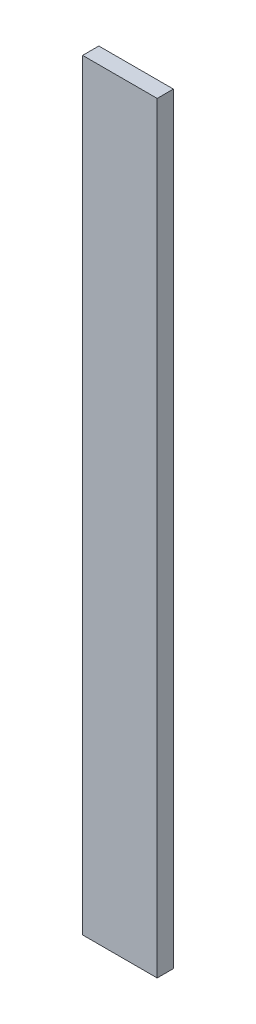
ISO-10303-21;
HEADER;
FILE_DESCRIPTION(('STEP AP214'),'2;1');
FILE_NAME('part.step','',(''),(''),'','','');
FILE_SCHEMA(('AUTOMOTIVE_DESIGN { 1 0 10303 214 1 1 1 1 }'));
ENDSEC;
DATA;
#1=APPLICATION_CONTEXT('core data for automotive mechanical design processes');
#2=APPLICATION_PROTOCOL_DEFINITION('international standard','automotive_design',2000,#1);
#3=PRODUCT_CONTEXT('',#1,'mechanical');
#4=PRODUCT('Part','Part','',(#3));
#5=PRODUCT_RELATED_PRODUCT_CATEGORY('part','',(#4));
#6=PRODUCT_DEFINITION_FORMATION('','',#4);
#7=PRODUCT_DEFINITION_CONTEXT('part definition',#1,'design');
#8=PRODUCT_DEFINITION('design','',#6,#7);
#9=PRODUCT_DEFINITION_SHAPE('','',#8);
#10=(LENGTH_UNIT() NAMED_UNIT(*) SI_UNIT(.MILLI.,.METRE.));
#11=(NAMED_UNIT(*) PLANE_ANGLE_UNIT() SI_UNIT($,.RADIAN.));
#12=(NAMED_UNIT(*) SI_UNIT($,.STERADIAN.) SOLID_ANGLE_UNIT());
#13=UNCERTAINTY_MEASURE_WITH_UNIT(LENGTH_MEASURE(1.E-05),#10,'distance_accuracy_value','');
#14=(GEOMETRIC_REPRESENTATION_CONTEXT(3) GLOBAL_UNCERTAINTY_ASSIGNED_CONTEXT((#13)) GLOBAL_UNIT_ASSIGNED_CONTEXT((#10,
#11,#12)) REPRESENTATION_CONTEXT('',''));
#15=CARTESIAN_POINT('',(0.,0.,0.));
#16=DIRECTION('',(0.,0.,1.));
#17=DIRECTION('',(1.,0.,0.));
#18=AXIS2_PLACEMENT_3D('',#15,#16,#17);
#19=CARTESIAN_POINT('',(1.15,-11.75,-0.5));
#20=DIRECTION('',(1.,0.,0.));
#21=DIRECTION('',(0.,0.,-1.));
#22=AXIS2_PLACEMENT_3D('',#19,#20,#21);
#23=PLANE('',#22);
#24=DIRECTION('',(0.,1.,0.));
#25=VECTOR('',#24,1.);
#26=CARTESIAN_POINT('',(1.15,-11.75,0.));
#27=LINE('',#26,#25);
#28=CARTESIAN_POINT('',(1.15,-11.75,0.));
#29=VERTEX_POINT('',#28);
#30=CARTESIAN_POINT('',(1.15,11.75,0.));
#31=VERTEX_POINT('',#30);
#32=EDGE_CURVE('E99',#29,#31,#27,.T.);
#33=ORIENTED_EDGE('',*,*,#32,.F.);
#34=DIRECTION('',(0.,0.,1.));
#35=VECTOR('',#34,1.);
#36=CARTESIAN_POINT('',(1.15,-11.75,-0.5));
#37=LINE('',#36,#35);
#38=CARTESIAN_POINT('',(1.15,-11.75,-0.5));
#39=VERTEX_POINT('',#38);
#40=EDGE_CURVE('E11',#39,#29,#37,.T.);
#41=ORIENTED_EDGE('',*,*,#40,.F.);
#42=DIRECTION('',(0.,1.,0.));
#43=VECTOR('',#42,1.);
#44=CARTESIAN_POINT('',(1.15,-11.75,-0.5));
#45=LINE('',#44,#43);
#46=CARTESIAN_POINT('',(1.15,11.75,-0.5));
#47=VERTEX_POINT('',#46);
#48=EDGE_CURVE('E93',#39,#47,#45,.T.);
#49=ORIENTED_EDGE('',*,*,#48,.T.);
#50=DIRECTION('',(0.,0.,1.));
#51=VECTOR('',#50,1.);
#52=CARTESIAN_POINT('',(1.15,11.75,-0.5));
#53=LINE('',#52,#51);
#54=EDGE_CURVE('E38',#47,#31,#53,.T.);
#55=ORIENTED_EDGE('',*,*,#54,.T.);
#56=EDGE_LOOP('',(#33,#41,#49,#55));
#57=FACE_BOUND('',#56,.T.);
#58=ADVANCED_FACE('F35',(#57),#23,.T.);
#59=CARTESIAN_POINT('',(-1.15,-11.75,-0.5));
#60=DIRECTION('',(0.,-1.,0.));
#61=DIRECTION('',(0.,0.,-1.));
#62=AXIS2_PLACEMENT_3D('',#59,#60,#61);
#63=PLANE('',#62);
#64=DIRECTION('',(1.,0.,0.));
#65=VECTOR('',#64,1.);
#66=CARTESIAN_POINT('',(-1.15,-11.75,0.));
#67=LINE('',#66,#65);
#68=CARTESIAN_POINT('',(-1.15,-11.75,0.));
#69=VERTEX_POINT('',#68);
#70=EDGE_CURVE('E95',#69,#29,#67,.T.);
#71=ORIENTED_EDGE('',*,*,#70,.F.);
#72=DIRECTION('',(0.,0.,1.));
#73=VECTOR('',#72,1.);
#74=CARTESIAN_POINT('',(-1.15,-11.75,-0.5));
#75=LINE('',#74,#73);
#76=CARTESIAN_POINT('',(-1.15,-11.75,-0.5));
#77=VERTEX_POINT('',#76);
#78=EDGE_CURVE('E44',#77,#69,#75,.T.);
#79=ORIENTED_EDGE('',*,*,#78,.F.);
#80=DIRECTION('',(1.,0.,0.));
#81=VECTOR('',#80,1.);
#82=CARTESIAN_POINT('',(-1.15,-11.75,-0.5));
#83=LINE('',#82,#81);
#84=EDGE_CURVE('E90',#77,#39,#83,.T.);
#85=ORIENTED_EDGE('',*,*,#84,.T.);
#86=ORIENTED_EDGE('',*,*,#40,.T.);
#87=EDGE_LOOP('',(#71,#79,#85,#86));
#88=FACE_BOUND('',#87,.T.);
#89=ADVANCED_FACE('F109',(#88),#63,.T.);
#90=CARTESIAN_POINT('',(-1.15,-11.75,-0.5));
#91=DIRECTION('',(-1.,0.,0.));
#92=DIRECTION('',(0.,0.,1.));
#93=AXIS2_PLACEMENT_3D('',#90,#91,#92);
#94=PLANE('',#93);
#95=DIRECTION('',(0.,-1.,0.));
#96=VECTOR('',#95,1.);
#97=CARTESIAN_POINT('',(-1.15,-11.75,0.));
#98=LINE('',#97,#96);
#99=CARTESIAN_POINT('',(-1.15,11.75,0.));
#100=VERTEX_POINT('',#99);
#101=EDGE_CURVE('E85',#100,#69,#98,.T.);
#102=ORIENTED_EDGE('',*,*,#101,.F.);
#103=DIRECTION('',(0.,0.,1.));
#104=VECTOR('',#103,1.);
#105=CARTESIAN_POINT('',(-1.15,11.75,-0.5));
#106=LINE('',#105,#104);
#107=CARTESIAN_POINT('',(-1.15,11.75,-0.5));
#108=VERTEX_POINT('',#107);
#109=EDGE_CURVE('E80',#108,#100,#106,.T.);
#110=ORIENTED_EDGE('',*,*,#109,.F.);
#111=DIRECTION('',(0.,-1.,0.));
#112=VECTOR('',#111,1.);
#113=CARTESIAN_POINT('',(-1.15,-11.75,-0.5));
#114=LINE('',#113,#112);
#115=EDGE_CURVE('E83',#108,#77,#114,.T.);
#116=ORIENTED_EDGE('',*,*,#115,.T.);
#117=ORIENTED_EDGE('',*,*,#78,.T.);
#118=EDGE_LOOP('',(#102,#110,#116,#117));
#119=FACE_BOUND('',#118,.T.);
#120=ADVANCED_FACE('F82',(#119),#94,.T.);
#121=CARTESIAN_POINT('',(-1.15,11.75,-0.5));
#122=DIRECTION('',(0.,1.,0.));
#123=DIRECTION('',(0.,0.,1.));
#124=AXIS2_PLACEMENT_3D('',#121,#122,#123);
#125=PLANE('',#124);
#126=DIRECTION('',(-1.,0.,0.));
#127=VECTOR('',#126,1.);
#128=CARTESIAN_POINT('',(-1.15,11.75,0.));
#129=LINE('',#128,#127);
#130=EDGE_CURVE('E102',#31,#100,#129,.T.);
#131=ORIENTED_EDGE('',*,*,#130,.F.);
#132=ORIENTED_EDGE('',*,*,#54,.F.);
#133=DIRECTION('',(-1.,0.,0.));
#134=VECTOR('',#133,1.);
#135=CARTESIAN_POINT('',(-1.15,11.75,-0.5));
#136=LINE('',#135,#134);
#137=EDGE_CURVE('E89',#47,#108,#136,.T.);
#138=ORIENTED_EDGE('',*,*,#137,.T.);
#139=ORIENTED_EDGE('',*,*,#109,.T.);
#140=EDGE_LOOP('',(#131,#132,#138,#139));
#141=FACE_BOUND('',#140,.T.);
#142=ADVANCED_FACE('F92',(#141),#125,.T.);
#143=CARTESIAN_POINT('',(0.,0.,-0.5));
#144=DIRECTION('',(0.,0.,-1.));
#145=DIRECTION('',(-1.,0.,0.));
#146=AXIS2_PLACEMENT_3D('',#143,#144,#145);
#147=PLANE('',#146);
#148=ORIENTED_EDGE('',*,*,#48,.F.);
#149=ORIENTED_EDGE('',*,*,#84,.F.);
#150=ORIENTED_EDGE('',*,*,#115,.F.);
#151=ORIENTED_EDGE('',*,*,#137,.F.);
#152=EDGE_LOOP('',(#148,#149,#150,#151));
#153=FACE_BOUND('',#152,.T.);
#154=ADVANCED_FACE('F88',(#153),#147,.T.);
#155=CARTESIAN_POINT('',(0.,0.,0.));
#156=DIRECTION('',(0.,0.,-1.));
#157=DIRECTION('',(-1.,0.,0.));
#158=AXIS2_PLACEMENT_3D('',#155,#156,#157);
#159=PLANE('',#158);
#160=ORIENTED_EDGE('',*,*,#32,.T.);
#161=ORIENTED_EDGE('',*,*,#130,.T.);
#162=ORIENTED_EDGE('',*,*,#101,.T.);
#163=ORIENTED_EDGE('',*,*,#70,.T.);
#164=EDGE_LOOP('',(#160,#161,#162,#163));
#165=FACE_BOUND('',#164,.T.);
#166=ADVANCED_FACE('F108',(#165),#159,.F.);
#167=CLOSED_SHELL('',(#58,#89,#120,#142,#154,#166));
#168=MANIFOLD_SOLID_BREP('B2',#167);
#169=ADVANCED_BREP_SHAPE_REPRESENTATION('',(#18,#168),#14);
#170=SHAPE_DEFINITION_REPRESENTATION(#9,#169);
ENDSEC;
END-ISO-10303-21;
